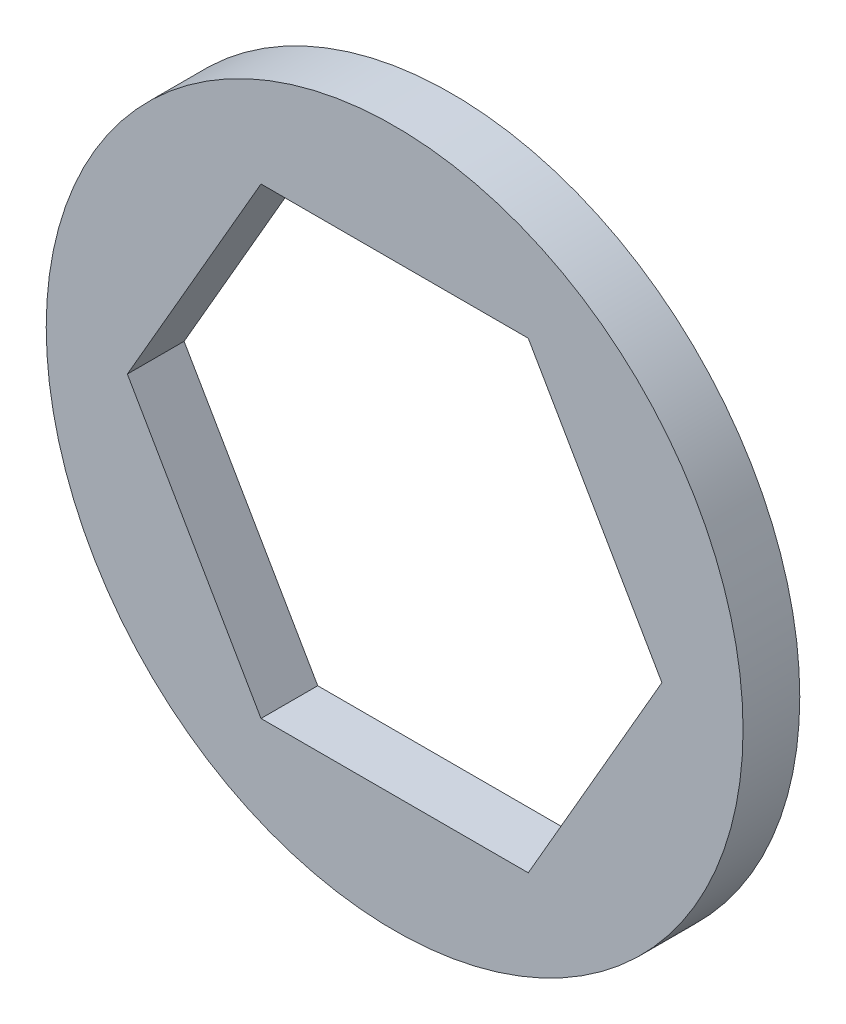
ISO-10303-21;
HEADER;
FILE_DESCRIPTION(('STEP AP214'),'2;1');
FILE_NAME('part.step','',(''),(''),'','','');
FILE_SCHEMA(('AUTOMOTIVE_DESIGN { 1 0 10303 214 1 1 1 1 }'));
ENDSEC;
DATA;
#1=APPLICATION_CONTEXT('core data for automotive mechanical design processes');
#2=APPLICATION_PROTOCOL_DEFINITION('international standard','automotive_design',2000,#1);
#3=PRODUCT_CONTEXT('',#1,'mechanical');
#4=PRODUCT('Part','Part','',(#3));
#5=PRODUCT_RELATED_PRODUCT_CATEGORY('part','',(#4));
#6=PRODUCT_DEFINITION_FORMATION('','',#4);
#7=PRODUCT_DEFINITION_CONTEXT('part definition',#1,'design');
#8=PRODUCT_DEFINITION('design','',#6,#7);
#9=PRODUCT_DEFINITION_SHAPE('','',#8);
#10=(LENGTH_UNIT() NAMED_UNIT(*) SI_UNIT(.MILLI.,.METRE.));
#11=(NAMED_UNIT(*) PLANE_ANGLE_UNIT() SI_UNIT($,.RADIAN.));
#12=(NAMED_UNIT(*) SI_UNIT($,.STERADIAN.) SOLID_ANGLE_UNIT());
#13=UNCERTAINTY_MEASURE_WITH_UNIT(LENGTH_MEASURE(1.E-05),#10,'distance_accuracy_value','');
#14=(GEOMETRIC_REPRESENTATION_CONTEXT(3) GLOBAL_UNCERTAINTY_ASSIGNED_CONTEXT((#13)) GLOBAL_UNIT_ASSIGNED_CONTEXT((#10,
#11,#12)) REPRESENTATION_CONTEXT('',''));
#15=CARTESIAN_POINT('',(0.,0.,0.));
#16=DIRECTION('',(0.,0.,1.));
#17=DIRECTION('',(1.,0.,0.));
#18=AXIS2_PLACEMENT_3D('',#15,#16,#17);
#19=CARTESIAN_POINT('',(0.,0.,0.79375));
#20=DIRECTION('',(0.,0.,1.));
#21=DIRECTION('',(1.,0.,0.));
#22=AXIS2_PLACEMENT_3D('',#19,#20,#21);
#23=PLANE('',#22);
#24=DIRECTION('',(1.,0.,0.));
#25=VECTOR('',#24,1.);
#26=CARTESIAN_POINT('',(3.7394976935412,6.477,0.79375));
#27=LINE('',#26,#25);
#28=CARTESIAN_POINT('',(3.7394976935412,6.477,0.79375));
#29=VERTEX_POINT('',#28);
#30=CARTESIAN_POINT('',(-3.73949769354121,6.477,0.79375));
#31=VERTEX_POINT('',#30);
#32=EDGE_CURVE('E65',#29,#31,#27,.F.);
#33=ORIENTED_EDGE('',*,*,#32,.F.);
#34=DIRECTION('',(0.5,-0.866025403784439,0.));
#35=VECTOR('',#34,1.);
#36=CARTESIAN_POINT('',(7.47899538708241,0.,0.79375));
#37=LINE('',#36,#35);
#38=CARTESIAN_POINT('',(7.47899538708242,0.,0.79375));
#39=VERTEX_POINT('',#38);
#40=EDGE_CURVE('E113',#39,#29,#37,.F.);
#41=ORIENTED_EDGE('',*,*,#40,.F.);
#42=DIRECTION('',(-0.5,-0.866025403784439,0.));
#43=VECTOR('',#42,1.);
#44=CARTESIAN_POINT('',(3.73949769354121,-6.477,0.79375));
#45=LINE('',#44,#43);
#46=CARTESIAN_POINT('',(3.73949769354121,-6.477,0.79375));
#47=VERTEX_POINT('',#46);
#48=EDGE_CURVE('E109',#47,#39,#45,.F.);
#49=ORIENTED_EDGE('',*,*,#48,.F.);
#50=DIRECTION('',(1.,0.,0.));
#51=VECTOR('',#50,1.);
#52=CARTESIAN_POINT('',(-3.73949769354121,-6.477,0.79375));
#53=LINE('',#52,#51);
#54=CARTESIAN_POINT('',(-3.73949769354121,-6.477,0.79375));
#55=VERTEX_POINT('',#54);
#56=EDGE_CURVE('E84',#55,#47,#53,.T.);
#57=ORIENTED_EDGE('',*,*,#56,.F.);
#58=DIRECTION('',(-0.5,0.866025403784439,0.));
#59=VECTOR('',#58,1.);
#60=CARTESIAN_POINT('',(-7.47899538708241,0.,0.79375));
#61=LINE('',#60,#59);
#62=CARTESIAN_POINT('',(-7.47899538708241,0.,0.79375));
#63=VERTEX_POINT('',#62);
#64=EDGE_CURVE('E79',#63,#55,#61,.F.);
#65=ORIENTED_EDGE('',*,*,#64,.F.);
#66=DIRECTION('',(0.5,0.866025403784439,0.));
#67=VECTOR('',#66,1.);
#68=CARTESIAN_POINT('',(-3.73949769354121,6.477,0.79375));
#69=LINE('',#68,#67);
#70=EDGE_CURVE('E70',#31,#63,#69,.F.);
#71=ORIENTED_EDGE('',*,*,#70,.F.);
#72=EDGE_LOOP('',(#33,#41,#49,#57,#65,#71));
#73=FACE_BOUND('',#72,.T.);
#74=CARTESIAN_POINT('',(0.,0.,0.79375));
#75=DIRECTION('',(0.,0.,-1.));
#76=DIRECTION('',(-1.,0.,0.));
#77=AXIS2_PLACEMENT_3D('',#74,#75,#76);
#78=CIRCLE('',#77,9.75);
#79=CARTESIAN_POINT('',(-9.75,0.,0.79375));
#80=VERTEX_POINT('',#79);
#81=EDGE_CURVE('E19',#80,#80,#78,.T.);
#82=ORIENTED_EDGE('',*,*,#81,.F.);
#83=EDGE_LOOP('',(#82));
#84=FACE_BOUND('',#83,.T.);
#85=ADVANCED_FACE('F16',(#73,#84),#23,.T.);
#86=CARTESIAN_POINT('',(0.,0.,0.79375));
#87=DIRECTION('',(0.,0.,-1.));
#88=DIRECTION('',(-1.,0.,0.));
#89=AXIS2_PLACEMENT_3D('',#86,#87,#88);
#90=CYLINDRICAL_SURFACE('',#89,9.75);
#91=ORIENTED_EDGE('',*,*,#81,.T.);
#92=EDGE_LOOP('',(#91));
#93=FACE_BOUND('',#92,.T.);
#94=CARTESIAN_POINT('',(0.,0.,-0.79375));
#95=DIRECTION('',(0.,0.,-1.));
#96=DIRECTION('',(-1.,0.,0.));
#97=AXIS2_PLACEMENT_3D('',#94,#95,#96);
#98=CIRCLE('',#97,9.75);
#99=CARTESIAN_POINT('',(-9.75,0.,-0.79375));
#100=VERTEX_POINT('',#99);
#101=EDGE_CURVE('E95',#100,#100,#98,.F.);
#102=ORIENTED_EDGE('',*,*,#101,.T.);
#103=EDGE_LOOP('',(#102));
#104=FACE_BOUND('',#103,.T.);
#105=ADVANCED_FACE('F189',(#93,#104),#90,.T.);
#106=CARTESIAN_POINT('',(-7.47899538708241,0.,0.79375));
#107=DIRECTION('',(0.866025403784439,0.5,0.));
#108=DIRECTION('',(-0.5,0.866025403784439,0.));
#109=AXIS2_PLACEMENT_3D('',#106,#107,#108);
#110=PLANE('',#109);
#111=ORIENTED_EDGE('',*,*,#64,.T.);
#112=DIRECTION('',(0.,0.,1.));
#113=VECTOR('',#112,1.);
#114=CARTESIAN_POINT('',(-3.73949769354121,-6.477,0.79375));
#115=LINE('',#114,#113);
#116=CARTESIAN_POINT('',(-3.73949769354121,-6.477,-0.79375));
#117=VERTEX_POINT('',#116);
#118=EDGE_CURVE('E102',#117,#55,#115,.T.);
#119=ORIENTED_EDGE('',*,*,#118,.F.);
#120=DIRECTION('',(-0.5,0.866025403784439,0.));
#121=VECTOR('',#120,1.);
#122=CARTESIAN_POINT('',(-3.73949769354121,-6.477,-0.79375));
#123=LINE('',#122,#121);
#124=CARTESIAN_POINT('',(-7.47899538708241,0.,-0.79375));
#125=VERTEX_POINT('',#124);
#126=EDGE_CURVE('E91',#117,#125,#123,.T.);
#127=ORIENTED_EDGE('',*,*,#126,.T.);
#128=DIRECTION('',(0.,0.,1.));
#129=VECTOR('',#128,1.);
#130=CARTESIAN_POINT('',(-7.47899538708241,0.,0.79375));
#131=LINE('',#130,#129);
#132=EDGE_CURVE('E75',#63,#125,#131,.F.);
#133=ORIENTED_EDGE('',*,*,#132,.F.);
#134=EDGE_LOOP('',(#111,#119,#127,#133));
#135=FACE_BOUND('',#134,.T.);
#136=ADVANCED_FACE('F90',(#135),#110,.T.);
#137=CARTESIAN_POINT('',(-3.73949769354121,6.477,0.79375));
#138=DIRECTION('',(0.866025403784439,-0.5,0.));
#139=DIRECTION('',(0.5,0.866025403784439,0.));
#140=AXIS2_PLACEMENT_3D('',#137,#138,#139);
#141=PLANE('',#140);
#142=ORIENTED_EDGE('',*,*,#70,.T.);
#143=ORIENTED_EDGE('',*,*,#132,.T.);
#144=DIRECTION('',(0.5,0.866025403784439,0.));
#145=VECTOR('',#144,1.);
#146=CARTESIAN_POINT('',(-7.47899538708241,0.,-0.79375));
#147=LINE('',#146,#145);
#148=CARTESIAN_POINT('',(-3.73949769354121,6.477,-0.79375));
#149=VERTEX_POINT('',#148);
#150=EDGE_CURVE('E99',#125,#149,#147,.T.);
#151=ORIENTED_EDGE('',*,*,#150,.T.);
#152=DIRECTION('',(0.,0.,1.));
#153=VECTOR('',#152,1.);
#154=CARTESIAN_POINT('',(-3.73949769354121,6.477,0.79375));
#155=LINE('',#154,#153);
#156=EDGE_CURVE('E77',#31,#149,#155,.F.);
#157=ORIENTED_EDGE('',*,*,#156,.F.);
#158=EDGE_LOOP('',(#142,#143,#151,#157));
#159=FACE_BOUND('',#158,.T.);
#160=ADVANCED_FACE('F72',(#159),#141,.T.);
#161=CARTESIAN_POINT('',(3.7394976935412,6.477,0.79375));
#162=DIRECTION('',(0.,-1.,0.));
#163=DIRECTION('',(1.,0.,0.));
#164=AXIS2_PLACEMENT_3D('',#161,#162,#163);
#165=PLANE('',#164);
#166=ORIENTED_EDGE('',*,*,#32,.T.);
#167=ORIENTED_EDGE('',*,*,#156,.T.);
#168=DIRECTION('',(1.,0.,0.));
#169=VECTOR('',#168,1.);
#170=CARTESIAN_POINT('',(0.,6.477,-0.79375));
#171=LINE('',#170,#169);
#172=CARTESIAN_POINT('',(3.7394976935412,6.477,-0.79375));
#173=VERTEX_POINT('',#172);
#174=EDGE_CURVE('E117',#149,#173,#171,.T.);
#175=ORIENTED_EDGE('',*,*,#174,.T.);
#176=DIRECTION('',(0.,0.,1.));
#177=VECTOR('',#176,1.);
#178=CARTESIAN_POINT('',(3.7394976935412,6.47700000000001,0.79375));
#179=LINE('',#178,#177);
#180=EDGE_CURVE('E111',#29,#173,#179,.F.);
#181=ORIENTED_EDGE('',*,*,#180,.F.);
#182=EDGE_LOOP('',(#166,#167,#175,#181));
#183=FACE_BOUND('',#182,.T.);
#184=ADVANCED_FACE('F116',(#183),#165,.T.);
#185=CARTESIAN_POINT('',(7.47899538708241,0.,0.79375));
#186=DIRECTION('',(-0.866025403784439,-0.5,0.));
#187=DIRECTION('',(0.5,-0.866025403784439,0.));
#188=AXIS2_PLACEMENT_3D('',#185,#186,#187);
#189=PLANE('',#188);
#190=ORIENTED_EDGE('',*,*,#40,.T.);
#191=ORIENTED_EDGE('',*,*,#180,.T.);
#192=DIRECTION('',(0.5,-0.866025403784438,0.));
#193=VECTOR('',#192,1.);
#194=CARTESIAN_POINT('',(3.7394976935412,6.477,-0.79375));
#195=LINE('',#194,#193);
#196=CARTESIAN_POINT('',(7.47899538708241,0.,-0.79375));
#197=VERTEX_POINT('',#196);
#198=EDGE_CURVE('E124',#173,#197,#195,.T.);
#199=ORIENTED_EDGE('',*,*,#198,.T.);
#200=DIRECTION('',(0.,0.,1.));
#201=VECTOR('',#200,1.);
#202=CARTESIAN_POINT('',(7.47899538708242,0.,0.79375));
#203=LINE('',#202,#201);
#204=EDGE_CURVE('E107',#39,#197,#203,.F.);
#205=ORIENTED_EDGE('',*,*,#204,.F.);
#206=EDGE_LOOP('',(#190,#191,#199,#205));
#207=FACE_BOUND('',#206,.T.);
#208=ADVANCED_FACE('F133',(#207),#189,.T.);
#209=CARTESIAN_POINT('',(3.73949769354121,-6.477,0.79375));
#210=DIRECTION('',(-0.866025403784439,0.5,0.));
#211=DIRECTION('',(-0.5,-0.866025403784439,0.));
#212=AXIS2_PLACEMENT_3D('',#209,#210,#211);
#213=PLANE('',#212);
#214=ORIENTED_EDGE('',*,*,#48,.T.);
#215=ORIENTED_EDGE('',*,*,#204,.T.);
#216=DIRECTION('',(-0.5,-0.866025403784439,0.));
#217=VECTOR('',#216,1.);
#218=CARTESIAN_POINT('',(7.47899538708241,0.,-0.79375));
#219=LINE('',#218,#217);
#220=CARTESIAN_POINT('',(3.73949769354121,-6.477,-0.79375));
#221=VERTEX_POINT('',#220);
#222=EDGE_CURVE('E25',#197,#221,#219,.T.);
#223=ORIENTED_EDGE('',*,*,#222,.T.);
#224=DIRECTION('',(0.,0.,1.));
#225=VECTOR('',#224,1.);
#226=CARTESIAN_POINT('',(3.73949769354121,-6.477,0.79375));
#227=LINE('',#226,#225);
#228=EDGE_CURVE('E33',#47,#221,#227,.F.);
#229=ORIENTED_EDGE('',*,*,#228,.F.);
#230=EDGE_LOOP('',(#214,#215,#223,#229));
#231=FACE_BOUND('',#230,.T.);
#232=ADVANCED_FACE('F130',(#231),#213,.T.);
#233=CARTESIAN_POINT('',(-3.73949769354121,-6.477,0.79375));
#234=DIRECTION('',(0.,1.,0.));
#235=DIRECTION('',(0.,0.,1.));
#236=AXIS2_PLACEMENT_3D('',#233,#234,#235);
#237=PLANE('',#236);
#238=ORIENTED_EDGE('',*,*,#56,.T.);
#239=ORIENTED_EDGE('',*,*,#228,.T.);
#240=DIRECTION('',(1.,0.,0.));
#241=VECTOR('',#240,1.);
#242=CARTESIAN_POINT('',(0.,-6.477,-0.79375));
#243=LINE('',#242,#241);
#244=EDGE_CURVE('E11',#221,#117,#243,.F.);
#245=ORIENTED_EDGE('',*,*,#244,.T.);
#246=ORIENTED_EDGE('',*,*,#118,.T.);
#247=EDGE_LOOP('',(#238,#239,#245,#246));
#248=FACE_BOUND('',#247,.T.);
#249=ADVANCED_FACE('F142',(#248),#237,.T.);
#250=CARTESIAN_POINT('',(0.,0.,-0.79375));
#251=DIRECTION('',(0.,0.,1.));
#252=DIRECTION('',(1.,0.,0.));
#253=AXIS2_PLACEMENT_3D('',#250,#251,#252);
#254=PLANE('',#253);
#255=ORIENTED_EDGE('',*,*,#222,.F.);
#256=ORIENTED_EDGE('',*,*,#198,.F.);
#257=ORIENTED_EDGE('',*,*,#174,.F.);
#258=ORIENTED_EDGE('',*,*,#150,.F.);
#259=ORIENTED_EDGE('',*,*,#126,.F.);
#260=ORIENTED_EDGE('',*,*,#244,.F.);
#261=EDGE_LOOP('',(#255,#256,#257,#258,#259,#260));
#262=FACE_BOUND('',#261,.T.);
#263=ORIENTED_EDGE('',*,*,#101,.F.);
#264=EDGE_LOOP('',(#263));
#265=FACE_BOUND('',#264,.T.);
#266=ADVANCED_FACE('F121',(#262,#265),#254,.F.);
#267=CLOSED_SHELL('',(#85,#105,#136,#160,#184,#208,#232,#249,#266));
#268=MANIFOLD_SOLID_BREP('B1',#267);
#269=ADVANCED_BREP_SHAPE_REPRESENTATION('',(#18,#268),#14);
#270=SHAPE_DEFINITION_REPRESENTATION(#9,#269);
ENDSEC;
END-ISO-10303-21;
